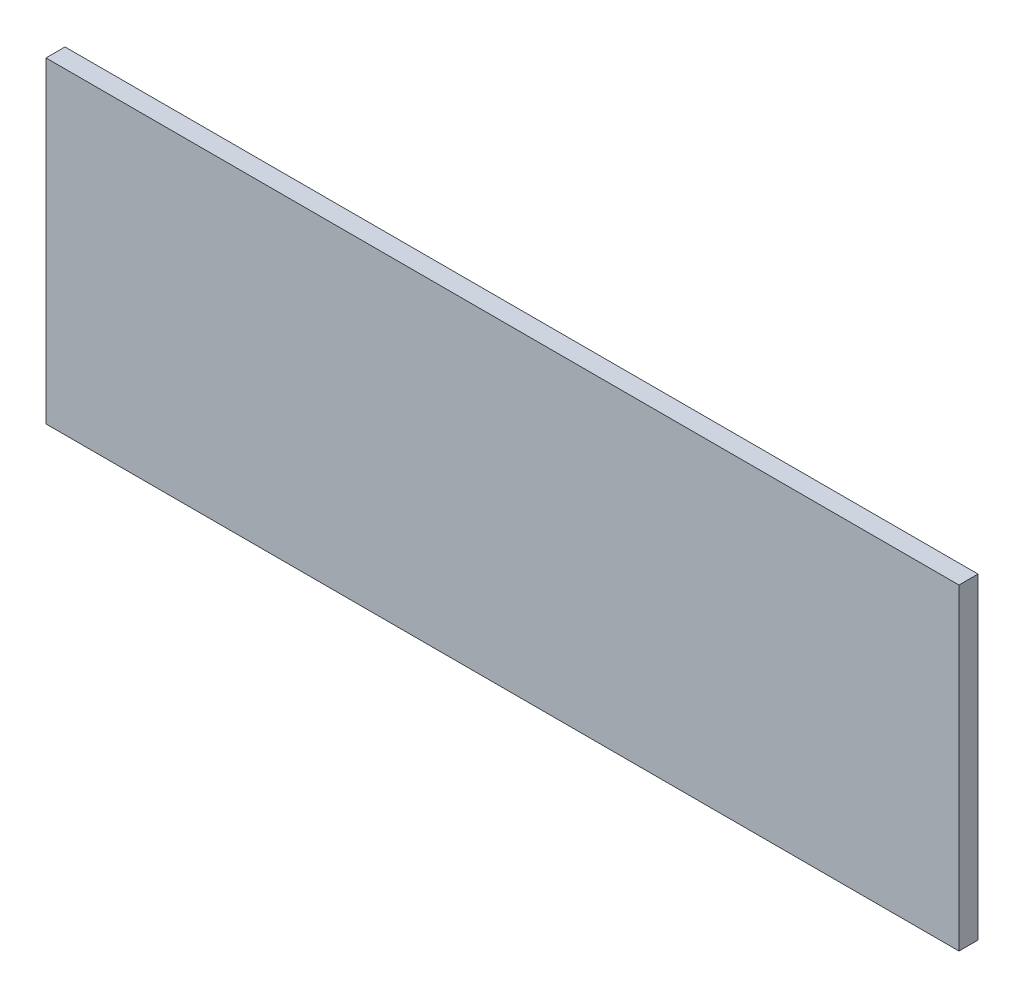
ISO-10303-21;
HEADER;
FILE_DESCRIPTION(('STEP AP214'),'2;1');
FILE_NAME('part.step','',(''),(''),'','','');
FILE_SCHEMA(('AUTOMOTIVE_DESIGN { 1 0 10303 214 1 1 1 1 }'));
ENDSEC;
DATA;
#1=APPLICATION_CONTEXT('core data for automotive mechanical design processes');
#2=APPLICATION_PROTOCOL_DEFINITION('international standard','automotive_design',2000,#1);
#3=PRODUCT_CONTEXT('',#1,'mechanical');
#4=PRODUCT('Part','Part','',(#3));
#5=PRODUCT_RELATED_PRODUCT_CATEGORY('part','',(#4));
#6=PRODUCT_DEFINITION_FORMATION('','',#4);
#7=PRODUCT_DEFINITION_CONTEXT('part definition',#1,'design');
#8=PRODUCT_DEFINITION('design','',#6,#7);
#9=PRODUCT_DEFINITION_SHAPE('','',#8);
#10=(LENGTH_UNIT() NAMED_UNIT(*) SI_UNIT(.MILLI.,.METRE.));
#11=(NAMED_UNIT(*) PLANE_ANGLE_UNIT() SI_UNIT($,.RADIAN.));
#12=(NAMED_UNIT(*) SI_UNIT($,.STERADIAN.) SOLID_ANGLE_UNIT());
#13=UNCERTAINTY_MEASURE_WITH_UNIT(LENGTH_MEASURE(1.E-05),#10,'distance_accuracy_value','');
#14=(GEOMETRIC_REPRESENTATION_CONTEXT(3) GLOBAL_UNCERTAINTY_ASSIGNED_CONTEXT((#13)) GLOBAL_UNIT_ASSIGNED_CONTEXT((#10,
#11,#12)) REPRESENTATION_CONTEXT('',''));
#15=CARTESIAN_POINT('',(0.,0.,0.));
#16=DIRECTION('',(0.,0.,1.));
#17=DIRECTION('',(1.,0.,0.));
#18=AXIS2_PLACEMENT_3D('',#15,#16,#17);
#19=CARTESIAN_POINT('',(-72.0000000000188,24.9999999999999,3.));
#20=DIRECTION('',(1.,0.,0.));
#21=DIRECTION('',(0.,0.,-1.));
#22=AXIS2_PLACEMENT_3D('',#19,#20,#21);
#23=PLANE('',#22);
#24=DIRECTION('',(0.,-1.,0.));
#25=VECTOR('',#24,1.);
#26=CARTESIAN_POINT('',(-72.0000000000188,24.9999999999999,0.));
#27=LINE('',#26,#25);
#28=CARTESIAN_POINT('',(-72.0000000000188,24.9999999999999,0.));
#29=VERTEX_POINT('',#28);
#30=CARTESIAN_POINT('',(-72.0000000000188,-24.9999999999999,0.));
#31=VERTEX_POINT('',#30);
#32=EDGE_CURVE('E96',#29,#31,#27,.T.);
#33=ORIENTED_EDGE('',*,*,#32,.T.);
#34=DIRECTION('',(0.,0.,-1.));
#35=VECTOR('',#34,1.);
#36=CARTESIAN_POINT('',(-72.0000000000188,-24.9999999999999,3.));
#37=LINE('',#36,#35);
#38=CARTESIAN_POINT('',(-72.0000000000188,-24.9999999999999,3.));
#39=VERTEX_POINT('',#38);
#40=EDGE_CURVE('E11',#39,#31,#37,.T.);
#41=ORIENTED_EDGE('',*,*,#40,.F.);
#42=DIRECTION('',(0.,-1.,0.));
#43=VECTOR('',#42,1.);
#44=CARTESIAN_POINT('',(-72.0000000000188,24.9999999999999,3.));
#45=LINE('',#44,#43);
#46=CARTESIAN_POINT('',(-72.0000000000188,24.9999999999999,3.));
#47=VERTEX_POINT('',#46);
#48=EDGE_CURVE('E84',#47,#39,#45,.T.);
#49=ORIENTED_EDGE('',*,*,#48,.F.);
#50=DIRECTION('',(0.,0.,-1.));
#51=VECTOR('',#50,1.);
#52=CARTESIAN_POINT('',(-72.0000000000188,24.9999999999999,3.));
#53=LINE('',#52,#51);
#54=EDGE_CURVE('E92',#47,#29,#53,.T.);
#55=ORIENTED_EDGE('',*,*,#54,.T.);
#56=EDGE_LOOP('',(#33,#41,#49,#55));
#57=FACE_BOUND('',#56,.T.);
#58=ADVANCED_FACE('F33',(#57),#23,.F.);
#59=CARTESIAN_POINT('',(-72.0000000000188,-24.9999999999999,3.));
#60=DIRECTION('',(0.,1.,0.));
#61=DIRECTION('',(0.,0.,1.));
#62=AXIS2_PLACEMENT_3D('',#59,#60,#61);
#63=PLANE('',#62);
#64=DIRECTION('',(1.,0.,0.));
#65=VECTOR('',#64,1.);
#66=CARTESIAN_POINT('',(-72.0000000000188,-24.9999999999999,0.));
#67=LINE('',#66,#65);
#68=CARTESIAN_POINT('',(72.0000000000188,-24.9999999999999,0.));
#69=VERTEX_POINT('',#68);
#70=EDGE_CURVE('E88',#31,#69,#67,.T.);
#71=ORIENTED_EDGE('',*,*,#70,.T.);
#72=DIRECTION('',(0.,0.,-1.));
#73=VECTOR('',#72,1.);
#74=CARTESIAN_POINT('',(72.0000000000188,-24.9999999999999,3.));
#75=LINE('',#74,#73);
#76=CARTESIAN_POINT('',(72.0000000000188,-24.9999999999999,3.));
#77=VERTEX_POINT('',#76);
#78=EDGE_CURVE('E41',#77,#69,#75,.T.);
#79=ORIENTED_EDGE('',*,*,#78,.F.);
#80=DIRECTION('',(1.,0.,0.));
#81=VECTOR('',#80,1.);
#82=CARTESIAN_POINT('',(-72.0000000000188,-24.9999999999999,3.));
#83=LINE('',#82,#81);
#84=EDGE_CURVE('E79',#39,#77,#83,.T.);
#85=ORIENTED_EDGE('',*,*,#84,.F.);
#86=ORIENTED_EDGE('',*,*,#40,.T.);
#87=EDGE_LOOP('',(#71,#79,#85,#86));
#88=FACE_BOUND('',#87,.T.);
#89=ADVANCED_FACE('F87',(#88),#63,.F.);
#90=CARTESIAN_POINT('',(72.0000000000188,24.9999999999999,3.));
#91=DIRECTION('',(-1.,0.,0.));
#92=DIRECTION('',(0.,0.,1.));
#93=AXIS2_PLACEMENT_3D('',#90,#91,#92);
#94=PLANE('',#93);
#95=DIRECTION('',(0.,1.,0.));
#96=VECTOR('',#95,1.);
#97=CARTESIAN_POINT('',(72.0000000000188,24.9999999999999,0.));
#98=LINE('',#97,#96);
#99=CARTESIAN_POINT('',(72.0000000000188,24.9999999999999,0.));
#100=VERTEX_POINT('',#99);
#101=EDGE_CURVE('E66',#69,#100,#98,.T.);
#102=ORIENTED_EDGE('',*,*,#101,.T.);
#103=DIRECTION('',(0.,0.,-1.));
#104=VECTOR('',#103,1.);
#105=CARTESIAN_POINT('',(72.0000000000188,24.9999999999999,3.));
#106=LINE('',#105,#104);
#107=CARTESIAN_POINT('',(72.0000000000188,24.9999999999999,3.));
#108=VERTEX_POINT('',#107);
#109=EDGE_CURVE('E89',#108,#100,#106,.T.);
#110=ORIENTED_EDGE('',*,*,#109,.F.);
#111=DIRECTION('',(0.,1.,0.));
#112=VECTOR('',#111,1.);
#113=CARTESIAN_POINT('',(72.0000000000188,24.9999999999999,3.));
#114=LINE('',#113,#112);
#115=EDGE_CURVE('E82',#77,#108,#114,.T.);
#116=ORIENTED_EDGE('',*,*,#115,.F.);
#117=ORIENTED_EDGE('',*,*,#78,.T.);
#118=EDGE_LOOP('',(#102,#110,#116,#117));
#119=FACE_BOUND('',#118,.T.);
#120=ADVANCED_FACE('F90',(#119),#94,.F.);
#121=CARTESIAN_POINT('',(-72.0000000000188,24.9999999999999,3.));
#122=DIRECTION('',(0.,-1.,0.));
#123=DIRECTION('',(0.,0.,-1.));
#124=AXIS2_PLACEMENT_3D('',#121,#122,#123);
#125=PLANE('',#124);
#126=DIRECTION('',(-1.,0.,0.));
#127=VECTOR('',#126,1.);
#128=CARTESIAN_POINT('',(-72.0000000000188,24.9999999999999,0.));
#129=LINE('',#128,#127);
#130=EDGE_CURVE('E72',#100,#29,#129,.T.);
#131=ORIENTED_EDGE('',*,*,#130,.T.);
#132=ORIENTED_EDGE('',*,*,#54,.F.);
#133=DIRECTION('',(-1.,0.,0.));
#134=VECTOR('',#133,1.);
#135=CARTESIAN_POINT('',(-72.0000000000188,24.9999999999999,3.));
#136=LINE('',#135,#134);
#137=EDGE_CURVE('E49',#108,#47,#136,.T.);
#138=ORIENTED_EDGE('',*,*,#137,.F.);
#139=ORIENTED_EDGE('',*,*,#109,.T.);
#140=EDGE_LOOP('',(#131,#132,#138,#139));
#141=FACE_BOUND('',#140,.T.);
#142=ADVANCED_FACE('F103',(#141),#125,.F.);
#143=CARTESIAN_POINT('',(0.,0.,3.));
#144=DIRECTION('',(0.,0.,1.));
#145=DIRECTION('',(1.,0.,0.));
#146=AXIS2_PLACEMENT_3D('',#143,#144,#145);
#147=PLANE('',#146);
#148=ORIENTED_EDGE('',*,*,#48,.T.);
#149=ORIENTED_EDGE('',*,*,#84,.T.);
#150=ORIENTED_EDGE('',*,*,#115,.T.);
#151=ORIENTED_EDGE('',*,*,#137,.T.);
#152=EDGE_LOOP('',(#148,#149,#150,#151));
#153=FACE_BOUND('',#152,.T.);
#154=ADVANCED_FACE('F80',(#153),#147,.T.);
#155=CARTESIAN_POINT('',(0.,0.,0.));
#156=DIRECTION('',(0.,0.,1.));
#157=DIRECTION('',(1.,0.,0.));
#158=AXIS2_PLACEMENT_3D('',#155,#156,#157);
#159=PLANE('',#158);
#160=ORIENTED_EDGE('',*,*,#32,.F.);
#161=ORIENTED_EDGE('',*,*,#130,.F.);
#162=ORIENTED_EDGE('',*,*,#101,.F.);
#163=ORIENTED_EDGE('',*,*,#70,.F.);
#164=EDGE_LOOP('',(#160,#161,#162,#163));
#165=FACE_BOUND('',#164,.T.);
#166=ADVANCED_FACE('F106',(#165),#159,.F.);
#167=CLOSED_SHELL('',(#58,#89,#120,#142,#154,#166));
#168=MANIFOLD_SOLID_BREP('B2',#167);
#169=ADVANCED_BREP_SHAPE_REPRESENTATION('',(#18,#168),#14);
#170=SHAPE_DEFINITION_REPRESENTATION(#9,#169);
ENDSEC;
END-ISO-10303-21;
